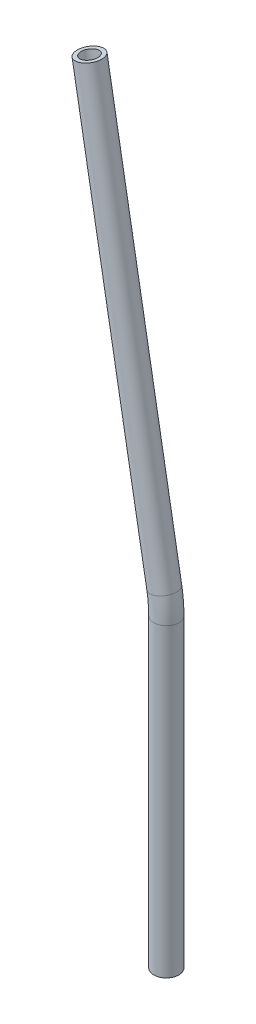
ISO-10303-21;
HEADER;
FILE_DESCRIPTION(('STEP AP214'),'2;1');
FILE_NAME('part.step','',(''),(''),'','','');
FILE_SCHEMA(('AUTOMOTIVE_DESIGN { 1 0 10303 214 1 1 1 1 }'));
ENDSEC;
DATA;
#1=APPLICATION_CONTEXT('core data for automotive mechanical design processes');
#2=APPLICATION_PROTOCOL_DEFINITION('international standard','automotive_design',2000,#1);
#3=PRODUCT_CONTEXT('',#1,'mechanical');
#4=PRODUCT('Part','Part','',(#3));
#5=PRODUCT_RELATED_PRODUCT_CATEGORY('part','',(#4));
#6=PRODUCT_DEFINITION_FORMATION('','',#4);
#7=PRODUCT_DEFINITION_CONTEXT('part definition',#1,'design');
#8=PRODUCT_DEFINITION('design','',#6,#7);
#9=PRODUCT_DEFINITION_SHAPE('','',#8);
#10=(LENGTH_UNIT() NAMED_UNIT(*) SI_UNIT(.MILLI.,.METRE.));
#11=(NAMED_UNIT(*) PLANE_ANGLE_UNIT() SI_UNIT($,.RADIAN.));
#12=(NAMED_UNIT(*) SI_UNIT($,.STERADIAN.) SOLID_ANGLE_UNIT());
#13=UNCERTAINTY_MEASURE_WITH_UNIT(LENGTH_MEASURE(1.E-05),#10,'distance_accuracy_value','');
#14=(GEOMETRIC_REPRESENTATION_CONTEXT(3) GLOBAL_UNCERTAINTY_ASSIGNED_CONTEXT((#13)) GLOBAL_UNIT_ASSIGNED_CONTEXT((#10,
#11,#12)) REPRESENTATION_CONTEXT('',''));
#15=CARTESIAN_POINT('',(0.,0.,0.));
#16=DIRECTION('',(0.,0.,1.));
#17=DIRECTION('',(1.,0.,0.));
#18=AXIS2_PLACEMENT_3D('',#15,#16,#17);
#19=CARTESIAN_POINT('',(0.,0.,0.));
#20=DIRECTION('',(0.,1.,0.));
#21=DIRECTION('',(-1.,0.,0.));
#22=AXIS2_PLACEMENT_3D('',#19,#20,#21);
#23=CYLINDRICAL_SURFACE('',#22,0.23622);
#24=CARTESIAN_POINT('',(0.,5.77777879464414,0.));
#25=DIRECTION('',(0.,1.,0.));
#26=DIRECTION('',(0.,0.,1.));
#27=AXIS2_PLACEMENT_3D('',#24,#25,#26);
#28=CIRCLE('',#27,0.23622);
#29=CARTESIAN_POINT('',(0.23622,5.77777879464414,0.));
#30=VERTEX_POINT('',#29);
#31=EDGE_CURVE('E68',#30,#30,#28,.T.);
#32=ORIENTED_EDGE('',*,*,#31,.F.);
#33=EDGE_LOOP('',(#32));
#34=FACE_BOUND('',#33,.T.);
#35=CARTESIAN_POINT('',(0.,0.,0.));
#36=DIRECTION('',(0.,1.,0.));
#37=DIRECTION('',(0.,0.,1.));
#38=AXIS2_PLACEMENT_3D('',#35,#36,#37);
#39=CIRCLE('',#38,0.23622);
#40=CARTESIAN_POINT('',(0.,0.,0.23622));
#41=VERTEX_POINT('',#40);
#42=EDGE_CURVE('E65',#41,#41,#39,.T.);
#43=ORIENTED_EDGE('',*,*,#42,.T.);
#44=EDGE_LOOP('',(#43));
#45=FACE_BOUND('',#44,.T.);
#46=ADVANCED_FACE('F41',(#34,#45),#23,.T.);
#47=CARTESIAN_POINT('',(-2.54,5.77777879464415,0.));
#48=DIRECTION('',(0.,0.,1.));
#49=DIRECTION('',(1.,0.,0.));
#50=AXIS2_PLACEMENT_3D('',#47,#48,#49);
#51=TOROIDAL_SURFACE('',#50,2.54,0.23622);
#52=CARTESIAN_POINT('',(-0.0385883073489939,6.21884516591817,0.));
#53=DIRECTION('',(-0.173648177666935,0.984807753012207,0.));
#54=DIRECTION('',(0.,0.,1.));
#55=AXIS2_PLACEMENT_3D('',#52,#53,#54);
#56=CIRCLE('',#55,0.23622);
#57=CARTESIAN_POINT('',(0.19404298006755,6.25986433844665,0.));
#58=VERTEX_POINT('',#57);
#59=EDGE_CURVE('E45',#58,#58,#56,.T.);
#60=CARTESIAN_POINT('',(-2.54,5.77777879464415,0.));
#61=DIRECTION('',(0.,0.,1.));
#62=DIRECTION('',(1.,0.,0.));
#63=AXIS2_PLACEMENT_3D('',#60,#61,#62);
#64=CIRCLE('',#63,2.77622);
#65=EDGE_CURVE('',#30,#58,#64,.T.);
#66=ORIENTED_EDGE('',*,*,#31,.T.);
#67=ORIENTED_EDGE('',*,*,#59,.F.);
#68=ORIENTED_EDGE('',*,*,#65,.T.);
#69=ORIENTED_EDGE('',*,*,#65,.F.);
#70=EDGE_LOOP('',(#66,#68,#67,#69));
#71=FACE_BOUND('',#70,.T.);
#72=ADVANCED_FACE('F78',(#71),#51,.T.);
#73=CARTESIAN_POINT('',(-0.038588307348994,6.21884516591817,0.));
#74=DIRECTION('',(-0.173648177666932,0.984807753012208,0.));
#75=DIRECTION('',(-0.984807753012208,-0.173648177666932,0.));
#76=AXIS2_PLACEMENT_3D('',#73,#74,#75);
#77=CYLINDRICAL_SURFACE('',#76,0.23622);
#78=CARTESIAN_POINT('',(-1.45509748596041,14.2522679178986,0.));
#79=DIRECTION('',(-0.173648177666932,0.984807753012208,0.));
#80=DIRECTION('',(0.,0.,1.));
#81=AXIS2_PLACEMENT_3D('',#78,#79,#80);
#82=CIRCLE('',#81,0.23622);
#83=CARTESIAN_POINT('',(-1.45509748596041,14.2522679178986,0.23622));
#84=VERTEX_POINT('',#83);
#85=EDGE_CURVE('E60',#84,#84,#82,.T.);
#86=ORIENTED_EDGE('',*,*,#85,.F.);
#87=EDGE_LOOP('',(#86));
#88=FACE_BOUND('',#87,.T.);
#89=ORIENTED_EDGE('',*,*,#59,.T.);
#90=EDGE_LOOP('',(#89));
#91=FACE_BOUND('',#90,.T.);
#92=ADVANCED_FACE('F43',(#88,#91),#77,.T.);
#93=CARTESIAN_POINT('',(0.,0.,0.));
#94=DIRECTION('',(0.,1.,0.));
#95=DIRECTION('',(0.,0.,1.));
#96=AXIS2_PLACEMENT_3D('',#93,#94,#95);
#97=PLANE('',#96);
#98=CARTESIAN_POINT('',(0.,0.,0.));
#99=DIRECTION('',(0.,1.,0.));
#100=DIRECTION('',(0.,0.,1.));
#101=AXIS2_PLACEMENT_3D('',#98,#99,#100);
#102=CIRCLE('',#101,0.16002);
#103=CARTESIAN_POINT('',(0.,0.,0.16002));
#104=VERTEX_POINT('',#103);
#105=EDGE_CURVE('E64',#104,#104,#102,.F.);
#106=ORIENTED_EDGE('',*,*,#105,.F.);
#107=EDGE_LOOP('',(#106));
#108=FACE_BOUND('',#107,.T.);
#109=ORIENTED_EDGE('',*,*,#42,.F.);
#110=EDGE_LOOP('',(#109));
#111=FACE_BOUND('',#110,.T.);
#112=ADVANCED_FACE('F84',(#108,#111),#97,.F.);
#113=CARTESIAN_POINT('',(-1.45509748596041,14.2522679178986,0.));
#114=DIRECTION('',(-0.173648177666932,0.984807753012208,0.));
#115=DIRECTION('',(0.,0.,1.));
#116=AXIS2_PLACEMENT_3D('',#113,#114,#115);
#117=PLANE('',#116);
#118=CARTESIAN_POINT('',(-1.45509748596041,14.2522679178986,0.));
#119=DIRECTION('',(-0.173648177666932,0.984807753012208,0.));
#120=DIRECTION('',(0.,0.,1.));
#121=AXIS2_PLACEMENT_3D('',#118,#119,#120);
#122=CIRCLE('',#121,0.16002);
#123=CARTESIAN_POINT('',(-1.45509748596041,14.2522679178986,0.16002));
#124=VERTEX_POINT('',#123);
#125=EDGE_CURVE('E10',#124,#124,#122,.F.);
#126=ORIENTED_EDGE('',*,*,#125,.T.);
#127=EDGE_LOOP('',(#126));
#128=FACE_BOUND('',#127,.T.);
#129=ORIENTED_EDGE('',*,*,#85,.T.);
#130=EDGE_LOOP('',(#129));
#131=FACE_BOUND('',#130,.T.);
#132=ADVANCED_FACE('F102',(#128,#131),#117,.T.);
#133=CARTESIAN_POINT('',(0.,0.,0.));
#134=DIRECTION('',(0.,1.,0.));
#135=DIRECTION('',(-1.,0.,0.));
#136=AXIS2_PLACEMENT_3D('',#133,#134,#135);
#137=CYLINDRICAL_SURFACE('',#136,0.16002);
#138=CARTESIAN_POINT('',(0.,5.77777879464414,0.));
#139=DIRECTION('',(0.,1.,0.));
#140=DIRECTION('',(0.,0.,1.));
#141=AXIS2_PLACEMENT_3D('',#138,#139,#140);
#142=CIRCLE('',#141,0.16002);
#143=CARTESIAN_POINT('',(0.16002,5.77777879464414,0.));
#144=VERTEX_POINT('',#143);
#145=EDGE_CURVE('E56',#144,#144,#142,.F.);
#146=ORIENTED_EDGE('',*,*,#145,.F.);
#147=EDGE_LOOP('',(#146));
#148=FACE_BOUND('',#147,.T.);
#149=ORIENTED_EDGE('',*,*,#105,.T.);
#150=EDGE_LOOP('',(#149));
#151=FACE_BOUND('',#150,.T.);
#152=ADVANCED_FACE('F96',(#148,#151),#137,.F.);
#153=CARTESIAN_POINT('',(-2.54,5.77777879464415,0.));
#154=DIRECTION('',(0.,0.,1.));
#155=DIRECTION('',(1.,0.,0.));
#156=AXIS2_PLACEMENT_3D('',#153,#154,#155);
#157=TOROIDAL_SURFACE('',#156,2.54,0.16002);
#158=CARTESIAN_POINT('',(-0.0385883073489939,6.21884516591817,0.));
#159=DIRECTION('',(-0.173648177666935,0.984807753012207,0.));
#160=DIRECTION('',(0.,0.,1.));
#161=AXIS2_PLACEMENT_3D('',#158,#159,#160);
#162=CIRCLE('',#161,0.16002);
#163=CARTESIAN_POINT('',(0.119000629288019,6.24663234730843,0.));
#164=VERTEX_POINT('',#163);
#165=EDGE_CURVE('E50',#164,#164,#162,.F.);
#166=CARTESIAN_POINT('',(-2.54,5.77777879464415,0.));
#167=DIRECTION('',(0.,0.,1.));
#168=DIRECTION('',(1.,0.,0.));
#169=AXIS2_PLACEMENT_3D('',#166,#167,#168);
#170=CIRCLE('',#169,2.70002);
#171=EDGE_CURVE('',#144,#164,#170,.T.);
#172=ORIENTED_EDGE('',*,*,#145,.T.);
#173=ORIENTED_EDGE('',*,*,#165,.F.);
#174=ORIENTED_EDGE('',*,*,#171,.T.);
#175=ORIENTED_EDGE('',*,*,#171,.F.);
#176=EDGE_LOOP('',(#172,#174,#173,#175));
#177=FACE_BOUND('',#176,.T.);
#178=ADVANCED_FACE('F90',(#177),#157,.F.);
#179=CARTESIAN_POINT('',(-0.038588307348994,6.21884516591817,0.));
#180=DIRECTION('',(-0.173648177666932,0.984807753012208,0.));
#181=DIRECTION('',(-0.984807753012208,-0.173648177666932,0.));
#182=AXIS2_PLACEMENT_3D('',#179,#180,#181);
#183=CYLINDRICAL_SURFACE('',#182,0.16002);
#184=ORIENTED_EDGE('',*,*,#125,.F.);
#185=EDGE_LOOP('',(#184));
#186=FACE_BOUND('',#185,.T.);
#187=ORIENTED_EDGE('',*,*,#165,.T.);
#188=EDGE_LOOP('',(#187));
#189=FACE_BOUND('',#188,.T.);
#190=ADVANCED_FACE('F88',(#186,#189),#183,.F.);
#191=CLOSED_SHELL('',(#46,#72,#92,#112,#132,#152,#178,#190));
#192=MANIFOLD_SOLID_BREP('B2',#191);
#193=ADVANCED_BREP_SHAPE_REPRESENTATION('',(#18,#192),#14);
#194=SHAPE_DEFINITION_REPRESENTATION(#9,#193);
ENDSEC;
END-ISO-10303-21;
